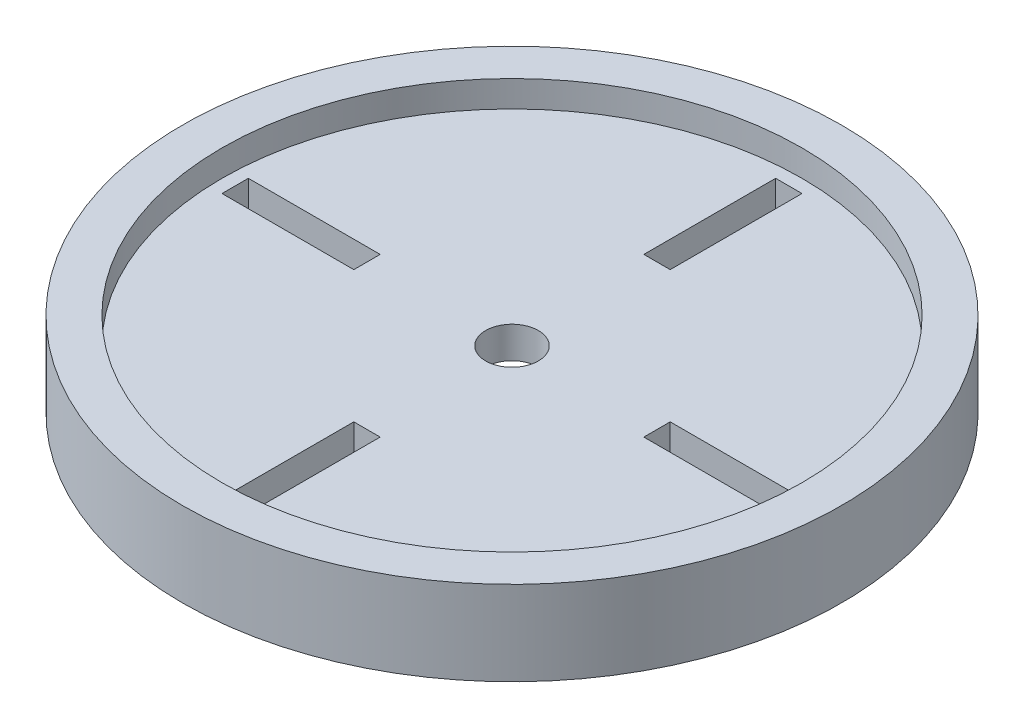
ISO-10303-21;
HEADER;
FILE_DESCRIPTION(('STEP AP214'),'2;1');
FILE_NAME('part.step','',(''),(''),'','','');
FILE_SCHEMA(('AUTOMOTIVE_DESIGN { 1 0 10303 214 1 1 1 1 }'));
ENDSEC;
DATA;
#1=APPLICATION_CONTEXT('core data for automotive mechanical design processes');
#2=APPLICATION_PROTOCOL_DEFINITION('international standard','automotive_design',2000,#1);
#3=PRODUCT_CONTEXT('',#1,'mechanical');
#4=PRODUCT('Part','Part','',(#3));
#5=PRODUCT_RELATED_PRODUCT_CATEGORY('part','',(#4));
#6=PRODUCT_DEFINITION_FORMATION('','',#4);
#7=PRODUCT_DEFINITION_CONTEXT('part definition',#1,'design');
#8=PRODUCT_DEFINITION('design','',#6,#7);
#9=PRODUCT_DEFINITION_SHAPE('','',#8);
#10=(LENGTH_UNIT() NAMED_UNIT(*) SI_UNIT(.MILLI.,.METRE.));
#11=(NAMED_UNIT(*) PLANE_ANGLE_UNIT() SI_UNIT($,.RADIAN.));
#12=(NAMED_UNIT(*) SI_UNIT($,.STERADIAN.) SOLID_ANGLE_UNIT());
#13=UNCERTAINTY_MEASURE_WITH_UNIT(LENGTH_MEASURE(1.E-05),#10,'distance_accuracy_value','');
#14=(GEOMETRIC_REPRESENTATION_CONTEXT(3) GLOBAL_UNCERTAINTY_ASSIGNED_CONTEXT((#13)) GLOBAL_UNIT_ASSIGNED_CONTEXT((#10,
#11,#12)) REPRESENTATION_CONTEXT('',''));
#15=CARTESIAN_POINT('',(0.,0.,0.));
#16=DIRECTION('',(0.,0.,1.));
#17=DIRECTION('',(1.,0.,0.));
#18=AXIS2_PLACEMENT_3D('',#15,#16,#17);
#19=CARTESIAN_POINT('',(0.,-8.,0.));
#20=DIRECTION('',(0.,1.,0.));
#21=DIRECTION('',(0.,0.,1.));
#22=AXIS2_PLACEMENT_3D('',#19,#20,#21);
#23=CYLINDRICAL_SURFACE('',#22,62.5);
#24=CARTESIAN_POINT('',(0.,-8.,0.));
#25=DIRECTION('',(0.,1.,0.));
#26=DIRECTION('',(0.,0.,1.));
#27=AXIS2_PLACEMENT_3D('',#24,#25,#26);
#28=CIRCLE('',#27,62.5);
#29=CARTESIAN_POINT('',(0.,-8.,62.5));
#30=VERTEX_POINT('',#29);
#31=EDGE_CURVE('E11',#30,#30,#28,.T.);
#32=ORIENTED_EDGE('',*,*,#31,.T.);
#33=EDGE_LOOP('',(#32));
#34=FACE_BOUND('',#33,.T.);
#35=CARTESIAN_POINT('',(0.,8.,0.));
#36=DIRECTION('',(0.,1.,0.));
#37=DIRECTION('',(0.,0.,1.));
#38=AXIS2_PLACEMENT_3D('',#35,#36,#37);
#39=CIRCLE('',#38,62.5);
#40=CARTESIAN_POINT('',(0.,8.,62.5));
#41=VERTEX_POINT('',#40);
#42=EDGE_CURVE('E44',#41,#41,#39,.T.);
#43=ORIENTED_EDGE('',*,*,#42,.F.);
#44=EDGE_LOOP('',(#43));
#45=FACE_BOUND('',#44,.T.);
#46=ADVANCED_FACE('F37',(#34,#45),#23,.T.);
#47=CARTESIAN_POINT('',(0.,-8.,0.));
#48=DIRECTION('',(0.,1.,0.));
#49=DIRECTION('',(0.,0.,1.));
#50=AXIS2_PLACEMENT_3D('',#47,#48,#49);
#51=PLANE('',#50);
#52=CARTESIAN_POINT('',(0.,-8.,0.));
#53=DIRECTION('',(0.,-1.,0.));
#54=DIRECTION('',(0.,0.,-1.));
#55=AXIS2_PLACEMENT_3D('',#52,#53,#54);
#56=CIRCLE('',#55,55.);
#57=CARTESIAN_POINT('',(0.,-8.,-55.));
#58=VERTEX_POINT('',#57);
#59=EDGE_CURVE('E277',#58,#58,#56,.T.);
#60=ORIENTED_EDGE('',*,*,#59,.F.);
#61=EDGE_LOOP('',(#60));
#62=FACE_BOUND('',#61,.T.);
#63=ORIENTED_EDGE('',*,*,#31,.F.);
#64=EDGE_LOOP('',(#63));
#65=FACE_BOUND('',#64,.T.);
#66=ADVANCED_FACE('F294',(#62,#65),#51,.F.);
#67=CARTESIAN_POINT('',(0.,8.,0.));
#68=DIRECTION('',(0.,1.,0.));
#69=DIRECTION('',(0.,0.,1.));
#70=AXIS2_PLACEMENT_3D('',#67,#68,#69);
#71=PLANE('',#70);
#72=CARTESIAN_POINT('',(0.,8.,0.));
#73=DIRECTION('',(0.,1.,0.));
#74=DIRECTION('',(0.,0.,1.));
#75=AXIS2_PLACEMENT_3D('',#72,#73,#74);
#76=CIRCLE('',#75,55.);
#77=CARTESIAN_POINT('',(0.,8.,55.));
#78=VERTEX_POINT('',#77);
#79=EDGE_CURVE('E281',#78,#78,#76,.T.);
#80=ORIENTED_EDGE('',*,*,#79,.F.);
#81=EDGE_LOOP('',(#80));
#82=FACE_BOUND('',#81,.T.);
#83=ORIENTED_EDGE('',*,*,#42,.T.);
#84=EDGE_LOOP('',(#83));
#85=FACE_BOUND('',#84,.T.);
#86=ADVANCED_FACE('F291',(#82,#85),#71,.T.);
#87=CARTESIAN_POINT('',(0.,3.,0.));
#88=DIRECTION('',(0.,1.,0.));
#89=DIRECTION('',(0.,0.,1.));
#90=AXIS2_PLACEMENT_3D('',#87,#88,#89);
#91=CYLINDRICAL_SURFACE('',#90,55.);
#92=CARTESIAN_POINT('',(0.,3.,0.));
#93=DIRECTION('',(0.,1.,0.));
#94=DIRECTION('',(0.,0.,1.));
#95=AXIS2_PLACEMENT_3D('',#92,#93,#94);
#96=CIRCLE('',#95,55.);
#97=CARTESIAN_POINT('',(0.,3.,55.));
#98=VERTEX_POINT('',#97);
#99=EDGE_CURVE('E284',#98,#98,#96,.T.);
#100=ORIENTED_EDGE('',*,*,#99,.F.);
#101=EDGE_LOOP('',(#100));
#102=FACE_BOUND('',#101,.T.);
#103=ORIENTED_EDGE('',*,*,#79,.T.);
#104=EDGE_LOOP('',(#103));
#105=FACE_BOUND('',#104,.T.);
#106=ADVANCED_FACE('F305',(#102,#105),#91,.F.);
#107=CARTESIAN_POINT('',(0.,3.,0.));
#108=DIRECTION('',(0.,1.,0.));
#109=DIRECTION('',(0.,0.,1.));
#110=AXIS2_PLACEMENT_3D('',#107,#108,#109);
#111=PLANE('',#110);
#112=DIRECTION('',(-1.,0.,0.));
#113=VECTOR('',#112,1.);
#114=CARTESIAN_POINT('',(0.,3.,-2.5));
#115=LINE('',#114,#113);
#116=CARTESIAN_POINT('',(-27.5,3.,-2.5000000000001));
#117=VERTEX_POINT('',#116);
#118=CARTESIAN_POINT('',(-52.5,3.,-2.50000000000018));
#119=VERTEX_POINT('',#118);
#120=EDGE_CURVE('E240',#117,#119,#115,.T.);
#121=ORIENTED_EDGE('',*,*,#120,.F.);
#122=DIRECTION('',(0.,0.,-1.));
#123=VECTOR('',#122,1.);
#124=CARTESIAN_POINT('',(-27.5,3.,0.));
#125=LINE('',#124,#123);
#126=CARTESIAN_POINT('',(-27.5,3.,2.4999999999999));
#127=VERTEX_POINT('',#126);
#128=EDGE_CURVE('E235',#127,#117,#125,.T.);
#129=ORIENTED_EDGE('',*,*,#128,.F.);
#130=DIRECTION('',(1.,0.,0.));
#131=VECTOR('',#130,1.);
#132=CARTESIAN_POINT('',(0.,3.,2.5));
#133=LINE('',#132,#131);
#134=CARTESIAN_POINT('',(-52.5,3.,2.49999999999982));
#135=VERTEX_POINT('',#134);
#136=EDGE_CURVE('E154',#135,#127,#133,.T.);
#137=ORIENTED_EDGE('',*,*,#136,.F.);
#138=DIRECTION('',(0.,0.,1.));
#139=VECTOR('',#138,1.);
#140=CARTESIAN_POINT('',(-52.5,3.,-1.83302770289265E-13));
#141=LINE('',#140,#139);
#142=EDGE_CURVE('E238',#119,#135,#141,.T.);
#143=ORIENTED_EDGE('',*,*,#142,.F.);
#144=EDGE_LOOP('',(#121,#129,#137,#143));
#145=FACE_BOUND('',#144,.T.);
#146=DIRECTION('',(0.,0.,-1.));
#147=VECTOR('',#146,1.);
#148=CARTESIAN_POINT('',(2.5,3.,0.));
#149=LINE('',#148,#147);
#150=CARTESIAN_POINT('',(2.5,3.,-27.5));
#151=VERTEX_POINT('',#150);
#152=CARTESIAN_POINT('',(2.5,3.,-52.5));
#153=VERTEX_POINT('',#152);
#154=EDGE_CURVE('E233',#151,#153,#149,.T.);
#155=ORIENTED_EDGE('',*,*,#154,.F.);
#156=DIRECTION('',(1.,0.,0.));
#157=VECTOR('',#156,1.);
#158=CARTESIAN_POINT('',(0.,3.,-27.5));
#159=LINE('',#158,#157);
#160=CARTESIAN_POINT('',(-2.5,3.,-27.5));
#161=VERTEX_POINT('',#160);
#162=EDGE_CURVE('E227',#161,#151,#159,.T.);
#163=ORIENTED_EDGE('',*,*,#162,.F.);
#164=DIRECTION('',(0.,0.,1.));
#165=VECTOR('',#164,1.);
#166=CARTESIAN_POINT('',(-2.5,3.,0.));
#167=LINE('',#166,#165);
#168=CARTESIAN_POINT('',(-2.5,3.,-52.5));
#169=VERTEX_POINT('',#168);
#170=EDGE_CURVE('E229',#169,#161,#167,.T.);
#171=ORIENTED_EDGE('',*,*,#170,.F.);
#172=DIRECTION('',(-1.,0.,0.));
#173=VECTOR('',#172,1.);
#174=CARTESIAN_POINT('',(0.,3.,-52.5));
#175=LINE('',#174,#173);
#176=EDGE_CURVE('E231',#153,#169,#175,.T.);
#177=ORIENTED_EDGE('',*,*,#176,.F.);
#178=EDGE_LOOP('',(#155,#163,#171,#177));
#179=FACE_BOUND('',#178,.T.);
#180=DIRECTION('',(1.,0.,0.));
#181=VECTOR('',#180,1.);
#182=CARTESIAN_POINT('',(0.,3.,2.5));
#183=LINE('',#182,#181);
#184=CARTESIAN_POINT('',(27.5,3.,2.50000000000029));
#185=VERTEX_POINT('',#184);
#186=CARTESIAN_POINT('',(52.5,3.,2.50000000000055));
#187=VERTEX_POINT('',#186);
#188=EDGE_CURVE('E225',#185,#187,#183,.T.);
#189=ORIENTED_EDGE('',*,*,#188,.F.);
#190=DIRECTION('',(0.,0.,1.));
#191=VECTOR('',#190,1.);
#192=CARTESIAN_POINT('',(27.5,3.,2.88047210454559E-13));
#193=LINE('',#192,#191);
#194=CARTESIAN_POINT('',(27.5,3.,-2.49999999999971));
#195=VERTEX_POINT('',#194);
#196=EDGE_CURVE('E178',#195,#185,#193,.T.);
#197=ORIENTED_EDGE('',*,*,#196,.F.);
#198=DIRECTION('',(-1.,0.,0.));
#199=VECTOR('',#198,1.);
#200=CARTESIAN_POINT('',(0.,3.,-2.5));
#201=LINE('',#200,#199);
#202=CARTESIAN_POINT('',(52.5,3.,-2.49999999999945));
#203=VERTEX_POINT('',#202);
#204=EDGE_CURVE('E220',#203,#195,#201,.T.);
#205=ORIENTED_EDGE('',*,*,#204,.F.);
#206=DIRECTION('',(0.,0.,-1.));
#207=VECTOR('',#206,1.);
#208=CARTESIAN_POINT('',(52.5,3.,5.49908310867794E-13));
#209=LINE('',#208,#207);
#210=EDGE_CURVE('E223',#187,#203,#209,.T.);
#211=ORIENTED_EDGE('',*,*,#210,.F.);
#212=EDGE_LOOP('',(#189,#197,#205,#211));
#213=FACE_BOUND('',#212,.T.);
#214=DIRECTION('',(0.,0.,1.));
#215=VECTOR('',#214,1.);
#216=CARTESIAN_POINT('',(-2.5,3.,0.));
#217=LINE('',#216,#215);
#218=CARTESIAN_POINT('',(-2.5,3.,27.5));
#219=VERTEX_POINT('',#218);
#220=CARTESIAN_POINT('',(-2.5,3.,52.5));
#221=VERTEX_POINT('',#220);
#222=EDGE_CURVE('E269',#219,#221,#217,.T.);
#223=ORIENTED_EDGE('',*,*,#222,.F.);
#224=DIRECTION('',(-1.,0.,0.));
#225=VECTOR('',#224,1.);
#226=CARTESIAN_POINT('',(0.,3.,27.5));
#227=LINE('',#226,#225);
#228=CARTESIAN_POINT('',(2.5,3.,27.5));
#229=VERTEX_POINT('',#228);
#230=EDGE_CURVE('E256',#229,#219,#227,.T.);
#231=ORIENTED_EDGE('',*,*,#230,.F.);
#232=DIRECTION('',(0.,0.,-1.));
#233=VECTOR('',#232,1.);
#234=CARTESIAN_POINT('',(2.5,3.,0.));
#235=LINE('',#234,#233);
#236=CARTESIAN_POINT('',(2.5,3.,52.5));
#237=VERTEX_POINT('',#236);
#238=EDGE_CURVE('E264',#237,#229,#235,.T.);
#239=ORIENTED_EDGE('',*,*,#238,.F.);
#240=DIRECTION('',(1.,0.,0.));
#241=VECTOR('',#240,1.);
#242=CARTESIAN_POINT('',(0.,3.,52.5));
#243=LINE('',#242,#241);
#244=EDGE_CURVE('E267',#221,#237,#243,.T.);
#245=ORIENTED_EDGE('',*,*,#244,.F.);
#246=EDGE_LOOP('',(#223,#231,#239,#245));
#247=FACE_BOUND('',#246,.T.);
#248=CARTESIAN_POINT('',(0.,3.,0.));
#249=DIRECTION('',(0.,1.,0.));
#250=DIRECTION('',(0.,0.,1.));
#251=AXIS2_PLACEMENT_3D('',#248,#249,#250);
#252=CIRCLE('',#251,5.);
#253=CARTESIAN_POINT('',(0.,3.,5.));
#254=VERTEX_POINT('',#253);
#255=EDGE_CURVE('E274',#254,#254,#252,.T.);
#256=ORIENTED_EDGE('',*,*,#255,.F.);
#257=EDGE_LOOP('',(#256));
#258=FACE_BOUND('',#257,.T.);
#259=ORIENTED_EDGE('',*,*,#99,.T.);
#260=EDGE_LOOP('',(#259));
#261=FACE_BOUND('',#260,.T.);
#262=ADVANCED_FACE('F312',(#145,#179,#213,#247,#258,#261),#111,.T.);
#263=CARTESIAN_POINT('',(0.,-3.,0.));
#264=DIRECTION('',(0.,-1.,0.));
#265=DIRECTION('',(0.,0.,-1.));
#266=AXIS2_PLACEMENT_3D('',#263,#264,#265);
#267=CYLINDRICAL_SURFACE('',#266,55.);
#268=CARTESIAN_POINT('',(0.,-3.,0.));
#269=DIRECTION('',(0.,-1.,0.));
#270=DIRECTION('',(0.,0.,-1.));
#271=AXIS2_PLACEMENT_3D('',#268,#269,#270);
#272=CIRCLE('',#271,55.);
#273=CARTESIAN_POINT('',(0.,-3.,-55.));
#274=VERTEX_POINT('',#273);
#275=EDGE_CURVE('E278',#274,#274,#272,.T.);
#276=ORIENTED_EDGE('',*,*,#275,.F.);
#277=EDGE_LOOP('',(#276));
#278=FACE_BOUND('',#277,.T.);
#279=ORIENTED_EDGE('',*,*,#59,.T.);
#280=EDGE_LOOP('',(#279));
#281=FACE_BOUND('',#280,.T.);
#282=ADVANCED_FACE('F316',(#278,#281),#267,.F.);
#283=CARTESIAN_POINT('',(0.,-3.,0.));
#284=DIRECTION('',(0.,-1.,0.));
#285=DIRECTION('',(0.,0.,-1.));
#286=AXIS2_PLACEMENT_3D('',#283,#284,#285);
#287=PLANE('',#286);
#288=DIRECTION('',(1.,0.,0.));
#289=VECTOR('',#288,1.);
#290=CARTESIAN_POINT('',(-27.5,-3.,-2.5000000000001));
#291=LINE('',#290,#289);
#292=CARTESIAN_POINT('',(-52.5,-3.,-2.50000000000018));
#293=VERTEX_POINT('',#292);
#294=CARTESIAN_POINT('',(-27.5,-3.,-2.5000000000001));
#295=VERTEX_POINT('',#294);
#296=EDGE_CURVE('E166',#293,#295,#291,.T.);
#297=ORIENTED_EDGE('',*,*,#296,.F.);
#298=DIRECTION('',(0.,0.,-1.));
#299=VECTOR('',#298,1.);
#300=CARTESIAN_POINT('',(-52.5,-3.,2.49999999999982));
#301=LINE('',#300,#299);
#302=CARTESIAN_POINT('',(-52.5,-3.,2.49999999999982));
#303=VERTEX_POINT('',#302);
#304=EDGE_CURVE('E171',#303,#293,#301,.T.);
#305=ORIENTED_EDGE('',*,*,#304,.F.);
#306=DIRECTION('',(-1.,0.,0.));
#307=VECTOR('',#306,1.);
#308=CARTESIAN_POINT('',(-27.5,-3.,2.4999999999999));
#309=LINE('',#308,#307);
#310=CARTESIAN_POINT('',(-27.5,-3.,2.4999999999999));
#311=VERTEX_POINT('',#310);
#312=EDGE_CURVE('E151',#311,#303,#309,.T.);
#313=ORIENTED_EDGE('',*,*,#312,.F.);
#314=DIRECTION('',(0.,0.,1.));
#315=VECTOR('',#314,1.);
#316=CARTESIAN_POINT('',(-27.5,-3.,2.4999999999999));
#317=LINE('',#316,#315);
#318=EDGE_CURVE('E161',#295,#311,#317,.T.);
#319=ORIENTED_EDGE('',*,*,#318,.F.);
#320=EDGE_LOOP('',(#297,#305,#313,#319));
#321=FACE_BOUND('',#320,.T.);
#322=DIRECTION('',(0.,0.,1.));
#323=VECTOR('',#322,1.);
#324=CARTESIAN_POINT('',(2.5,-3.,-27.5));
#325=LINE('',#324,#323);
#326=CARTESIAN_POINT('',(2.5,-3.,-52.5));
#327=VERTEX_POINT('',#326);
#328=CARTESIAN_POINT('',(2.5,-3.,-27.5));
#329=VERTEX_POINT('',#328);
#330=EDGE_CURVE('E181',#327,#329,#325,.T.);
#331=ORIENTED_EDGE('',*,*,#330,.F.);
#332=DIRECTION('',(1.,0.,0.));
#333=VECTOR('',#332,1.);
#334=CARTESIAN_POINT('',(-2.5,-3.,-52.5));
#335=LINE('',#334,#333);
#336=CARTESIAN_POINT('',(-2.5,-3.,-52.5));
#337=VERTEX_POINT('',#336);
#338=EDGE_CURVE('E189',#337,#327,#335,.T.);
#339=ORIENTED_EDGE('',*,*,#338,.F.);
#340=DIRECTION('',(0.,0.,-1.));
#341=VECTOR('',#340,1.);
#342=CARTESIAN_POINT('',(-2.5,-3.,-27.5));
#343=LINE('',#342,#341);
#344=CARTESIAN_POINT('',(-2.5,-3.,-27.5));
#345=VERTEX_POINT('',#344);
#346=EDGE_CURVE('E186',#345,#337,#343,.T.);
#347=ORIENTED_EDGE('',*,*,#346,.F.);
#348=DIRECTION('',(-1.,0.,0.));
#349=VECTOR('',#348,1.);
#350=CARTESIAN_POINT('',(-2.5,-3.,-27.5));
#351=LINE('',#350,#349);
#352=EDGE_CURVE('E183',#329,#345,#351,.T.);
#353=ORIENTED_EDGE('',*,*,#352,.F.);
#354=EDGE_LOOP('',(#331,#339,#347,#353));
#355=FACE_BOUND('',#354,.T.);
#356=DIRECTION('',(-1.,0.,0.));
#357=VECTOR('',#356,1.);
#358=CARTESIAN_POINT('',(27.5,-3.,2.50000000000029));
#359=LINE('',#358,#357);
#360=CARTESIAN_POINT('',(52.5,-3.,2.50000000000055));
#361=VERTEX_POINT('',#360);
#362=CARTESIAN_POINT('',(27.5,-3.,2.50000000000029));
#363=VERTEX_POINT('',#362);
#364=EDGE_CURVE('E200',#361,#363,#359,.T.);
#365=ORIENTED_EDGE('',*,*,#364,.F.);
#366=DIRECTION('',(0.,0.,1.));
#367=VECTOR('',#366,1.);
#368=CARTESIAN_POINT('',(52.5,-3.,-2.49999999999945));
#369=LINE('',#368,#367);
#370=CARTESIAN_POINT('',(52.5,-3.,-2.49999999999945));
#371=VERTEX_POINT('',#370);
#372=EDGE_CURVE('E208',#371,#361,#369,.T.);
#373=ORIENTED_EDGE('',*,*,#372,.F.);
#374=DIRECTION('',(1.,0.,0.));
#375=VECTOR('',#374,1.);
#376=CARTESIAN_POINT('',(27.5,-3.,-2.49999999999971));
#377=LINE('',#376,#375);
#378=CARTESIAN_POINT('',(27.5,-3.,-2.49999999999971));
#379=VERTEX_POINT('',#378);
#380=EDGE_CURVE('E205',#379,#371,#377,.T.);
#381=ORIENTED_EDGE('',*,*,#380,.F.);
#382=DIRECTION('',(0.,0.,-1.));
#383=VECTOR('',#382,1.);
#384=CARTESIAN_POINT('',(27.5,-3.,-2.49999999999971));
#385=LINE('',#384,#383);
#386=EDGE_CURVE('E202',#363,#379,#385,.T.);
#387=ORIENTED_EDGE('',*,*,#386,.F.);
#388=EDGE_LOOP('',(#365,#373,#381,#387));
#389=FACE_BOUND('',#388,.T.);
#390=DIRECTION('',(0.,0.,-1.));
#391=VECTOR('',#390,1.);
#392=CARTESIAN_POINT('',(-2.5,-3.,27.5));
#393=LINE('',#392,#391);
#394=CARTESIAN_POINT('',(-2.5,-3.,52.5));
#395=VERTEX_POINT('',#394);
#396=CARTESIAN_POINT('',(-2.5,-3.,27.5));
#397=VERTEX_POINT('',#396);
#398=EDGE_CURVE('E242',#395,#397,#393,.T.);
#399=ORIENTED_EDGE('',*,*,#398,.F.);
#400=DIRECTION('',(-1.,0.,0.));
#401=VECTOR('',#400,1.);
#402=CARTESIAN_POINT('',(2.5,-3.,52.5));
#403=LINE('',#402,#401);
#404=CARTESIAN_POINT('',(2.5,-3.,52.5));
#405=VERTEX_POINT('',#404);
#406=EDGE_CURVE('E250',#405,#395,#403,.T.);
#407=ORIENTED_EDGE('',*,*,#406,.F.);
#408=DIRECTION('',(0.,0.,1.));
#409=VECTOR('',#408,1.);
#410=CARTESIAN_POINT('',(2.5,-3.,27.5));
#411=LINE('',#410,#409);
#412=CARTESIAN_POINT('',(2.5,-3.,27.5));
#413=VERTEX_POINT('',#412);
#414=EDGE_CURVE('E247',#413,#405,#411,.T.);
#415=ORIENTED_EDGE('',*,*,#414,.F.);
#416=DIRECTION('',(1.,0.,0.));
#417=VECTOR('',#416,1.);
#418=CARTESIAN_POINT('',(2.5,-3.,27.5));
#419=LINE('',#418,#417);
#420=EDGE_CURVE('E244',#397,#413,#419,.T.);
#421=ORIENTED_EDGE('',*,*,#420,.F.);
#422=EDGE_LOOP('',(#399,#407,#415,#421));
#423=FACE_BOUND('',#422,.T.);
#424=CARTESIAN_POINT('',(0.,-3.,0.));
#425=DIRECTION('',(0.,-1.,0.));
#426=DIRECTION('',(0.,0.,-1.));
#427=AXIS2_PLACEMENT_3D('',#424,#425,#426);
#428=CIRCLE('',#427,5.);
#429=CARTESIAN_POINT('',(0.,-3.,-5.));
#430=VERTEX_POINT('',#429);
#431=EDGE_CURVE('E271',#430,#430,#428,.T.);
#432=ORIENTED_EDGE('',*,*,#431,.F.);
#433=EDGE_LOOP('',(#432));
#434=FACE_BOUND('',#433,.T.);
#435=ORIENTED_EDGE('',*,*,#275,.T.);
#436=EDGE_LOOP('',(#435));
#437=FACE_BOUND('',#436,.T.);
#438=ADVANCED_FACE('F168',(#321,#355,#389,#423,#434,#437),#287,.T.);
#439=CARTESIAN_POINT('',(0.,8.,0.));
#440=DIRECTION('',(0.,-1.,0.));
#441=DIRECTION('',(0.,0.,-1.));
#442=AXIS2_PLACEMENT_3D('',#439,#440,#441);
#443=CYLINDRICAL_SURFACE('',#442,5.);
#444=ORIENTED_EDGE('',*,*,#255,.T.);
#445=EDGE_LOOP('',(#444));
#446=FACE_BOUND('',#445,.T.);
#447=ORIENTED_EDGE('',*,*,#431,.T.);
#448=EDGE_LOOP('',(#447));
#449=FACE_BOUND('',#448,.T.);
#450=ADVANCED_FACE('F323',(#446,#449),#443,.F.);
#451=CARTESIAN_POINT('',(-2.5,8.,27.5));
#452=DIRECTION('',(-1.,0.,0.));
#453=DIRECTION('',(0.,0.,1.));
#454=AXIS2_PLACEMENT_3D('',#451,#452,#453);
#455=PLANE('',#454);
#456=ORIENTED_EDGE('',*,*,#222,.T.);
#457=DIRECTION('',(0.,-1.,0.));
#458=VECTOR('',#457,1.);
#459=CARTESIAN_POINT('',(-2.5,8.,52.5));
#460=LINE('',#459,#458);
#461=EDGE_CURVE('E254',#221,#395,#460,.T.);
#462=ORIENTED_EDGE('',*,*,#461,.T.);
#463=ORIENTED_EDGE('',*,*,#398,.T.);
#464=DIRECTION('',(0.,-1.,0.));
#465=VECTOR('',#464,1.);
#466=CARTESIAN_POINT('',(-2.5,8.,27.5));
#467=LINE('',#466,#465);
#468=EDGE_CURVE('E253',#219,#397,#467,.T.);
#469=ORIENTED_EDGE('',*,*,#468,.F.);
#470=EDGE_LOOP('',(#456,#462,#463,#469));
#471=FACE_BOUND('',#470,.T.);
#472=ADVANCED_FACE('F326',(#471),#455,.F.);
#473=CARTESIAN_POINT('',(2.5,8.,52.5));
#474=DIRECTION('',(0.,0.,1.));
#475=DIRECTION('',(1.,0.,0.));
#476=AXIS2_PLACEMENT_3D('',#473,#474,#475);
#477=PLANE('',#476);
#478=ORIENTED_EDGE('',*,*,#244,.T.);
#479=DIRECTION('',(0.,-1.,0.));
#480=VECTOR('',#479,1.);
#481=CARTESIAN_POINT('',(2.5,8.,52.5));
#482=LINE('',#481,#480);
#483=EDGE_CURVE('E257',#237,#405,#482,.T.);
#484=ORIENTED_EDGE('',*,*,#483,.T.);
#485=ORIENTED_EDGE('',*,*,#406,.T.);
#486=ORIENTED_EDGE('',*,*,#461,.F.);
#487=EDGE_LOOP('',(#478,#484,#485,#486));
#488=FACE_BOUND('',#487,.T.);
#489=ADVANCED_FACE('F330',(#488),#477,.F.);
#490=CARTESIAN_POINT('',(2.5,8.,27.5));
#491=DIRECTION('',(1.,0.,0.));
#492=DIRECTION('',(0.,0.,-1.));
#493=AXIS2_PLACEMENT_3D('',#490,#491,#492);
#494=PLANE('',#493);
#495=ORIENTED_EDGE('',*,*,#238,.T.);
#496=DIRECTION('',(0.,-1.,0.));
#497=VECTOR('',#496,1.);
#498=CARTESIAN_POINT('',(2.5,8.,27.5));
#499=LINE('',#498,#497);
#500=EDGE_CURVE('E259',#229,#413,#499,.T.);
#501=ORIENTED_EDGE('',*,*,#500,.T.);
#502=ORIENTED_EDGE('',*,*,#414,.T.);
#503=ORIENTED_EDGE('',*,*,#483,.F.);
#504=EDGE_LOOP('',(#495,#501,#502,#503));
#505=FACE_BOUND('',#504,.T.);
#506=ADVANCED_FACE('F336',(#505),#494,.F.);
#507=CARTESIAN_POINT('',(2.5,8.,27.5));
#508=DIRECTION('',(0.,0.,-1.));
#509=DIRECTION('',(-1.,0.,0.));
#510=AXIS2_PLACEMENT_3D('',#507,#508,#509);
#511=PLANE('',#510);
#512=ORIENTED_EDGE('',*,*,#230,.T.);
#513=ORIENTED_EDGE('',*,*,#468,.T.);
#514=ORIENTED_EDGE('',*,*,#420,.T.);
#515=ORIENTED_EDGE('',*,*,#500,.F.);
#516=EDGE_LOOP('',(#512,#513,#514,#515));
#517=FACE_BOUND('',#516,.T.);
#518=ADVANCED_FACE('F332',(#517),#511,.F.);
#519=CARTESIAN_POINT('',(27.5,8.,2.50000000000029));
#520=DIRECTION('',(0.,0.,1.));
#521=DIRECTION('',(1.,0.,0.));
#522=AXIS2_PLACEMENT_3D('',#519,#520,#521);
#523=PLANE('',#522);
#524=ORIENTED_EDGE('',*,*,#188,.T.);
#525=DIRECTION('',(0.,-1.,0.));
#526=VECTOR('',#525,1.);
#527=CARTESIAN_POINT('',(52.5,8.,2.50000000000055));
#528=LINE('',#527,#526);
#529=EDGE_CURVE('E184',#187,#361,#528,.T.);
#530=ORIENTED_EDGE('',*,*,#529,.T.);
#531=ORIENTED_EDGE('',*,*,#364,.T.);
#532=DIRECTION('',(0.,-1.,0.));
#533=VECTOR('',#532,1.);
#534=CARTESIAN_POINT('',(27.5,8.,2.50000000000029));
#535=LINE('',#534,#533);
#536=EDGE_CURVE('E211',#185,#363,#535,.T.);
#537=ORIENTED_EDGE('',*,*,#536,.F.);
#538=EDGE_LOOP('',(#524,#530,#531,#537));
#539=FACE_BOUND('',#538,.T.);
#540=ADVANCED_FACE('F335',(#539),#523,.F.);
#541=CARTESIAN_POINT('',(52.5,8.,-2.49999999999945));
#542=DIRECTION('',(1.,0.,0.));
#543=DIRECTION('',(0.,0.,-1.));
#544=AXIS2_PLACEMENT_3D('',#541,#542,#543);
#545=PLANE('',#544);
#546=ORIENTED_EDGE('',*,*,#210,.T.);
#547=DIRECTION('',(0.,-1.,0.));
#548=VECTOR('',#547,1.);
#549=CARTESIAN_POINT('',(52.5,8.,-2.49999999999945));
#550=LINE('',#549,#548);
#551=EDGE_CURVE('E213',#203,#371,#550,.T.);
#552=ORIENTED_EDGE('',*,*,#551,.T.);
#553=ORIENTED_EDGE('',*,*,#372,.T.);
#554=ORIENTED_EDGE('',*,*,#529,.F.);
#555=EDGE_LOOP('',(#546,#552,#553,#554));
#556=FACE_BOUND('',#555,.T.);
#557=ADVANCED_FACE('F346',(#556),#545,.F.);
#558=CARTESIAN_POINT('',(27.5,8.,-2.49999999999971));
#559=DIRECTION('',(0.,0.,-1.));
#560=DIRECTION('',(-1.,0.,0.));
#561=AXIS2_PLACEMENT_3D('',#558,#559,#560);
#562=PLANE('',#561);
#563=ORIENTED_EDGE('',*,*,#204,.T.);
#564=DIRECTION('',(0.,-1.,0.));
#565=VECTOR('',#564,1.);
#566=CARTESIAN_POINT('',(27.5,8.,-2.49999999999971));
#567=LINE('',#566,#565);
#568=EDGE_CURVE('E215',#195,#379,#567,.T.);
#569=ORIENTED_EDGE('',*,*,#568,.T.);
#570=ORIENTED_EDGE('',*,*,#380,.T.);
#571=ORIENTED_EDGE('',*,*,#551,.F.);
#572=EDGE_LOOP('',(#563,#569,#570,#571));
#573=FACE_BOUND('',#572,.T.);
#574=ADVANCED_FACE('F352',(#573),#562,.F.);
#575=CARTESIAN_POINT('',(27.5,8.,-2.49999999999971));
#576=DIRECTION('',(-1.,0.,0.));
#577=DIRECTION('',(0.,0.,1.));
#578=AXIS2_PLACEMENT_3D('',#575,#576,#577);
#579=PLANE('',#578);
#580=ORIENTED_EDGE('',*,*,#196,.T.);
#581=ORIENTED_EDGE('',*,*,#536,.T.);
#582=ORIENTED_EDGE('',*,*,#386,.T.);
#583=ORIENTED_EDGE('',*,*,#568,.F.);
#584=EDGE_LOOP('',(#580,#581,#582,#583));
#585=FACE_BOUND('',#584,.T.);
#586=ADVANCED_FACE('F348',(#585),#579,.F.);
#587=CARTESIAN_POINT('',(2.5,8.,-27.5));
#588=DIRECTION('',(1.,0.,0.));
#589=DIRECTION('',(0.,0.,-1.));
#590=AXIS2_PLACEMENT_3D('',#587,#588,#589);
#591=PLANE('',#590);
#592=ORIENTED_EDGE('',*,*,#154,.T.);
#593=DIRECTION('',(0.,-1.,0.));
#594=VECTOR('',#593,1.);
#595=CARTESIAN_POINT('',(2.5,8.,-52.5));
#596=LINE('',#595,#594);
#597=EDGE_CURVE('E193',#153,#327,#596,.T.);
#598=ORIENTED_EDGE('',*,*,#597,.T.);
#599=ORIENTED_EDGE('',*,*,#330,.T.);
#600=DIRECTION('',(0.,-1.,0.));
#601=VECTOR('',#600,1.);
#602=CARTESIAN_POINT('',(2.5,8.,-27.5));
#603=LINE('',#602,#601);
#604=EDGE_CURVE('E192',#151,#329,#603,.T.);
#605=ORIENTED_EDGE('',*,*,#604,.F.);
#606=EDGE_LOOP('',(#592,#598,#599,#605));
#607=FACE_BOUND('',#606,.T.);
#608=ADVANCED_FACE('F351',(#607),#591,.F.);
#609=CARTESIAN_POINT('',(-2.5,8.,-52.5));
#610=DIRECTION('',(0.,0.,-1.));
#611=DIRECTION('',(-1.,0.,0.));
#612=AXIS2_PLACEMENT_3D('',#609,#610,#611);
#613=PLANE('',#612);
#614=ORIENTED_EDGE('',*,*,#176,.T.);
#615=DIRECTION('',(0.,-1.,0.));
#616=VECTOR('',#615,1.);
#617=CARTESIAN_POINT('',(-2.5,8.,-52.5));
#618=LINE('',#617,#616);
#619=EDGE_CURVE('E195',#169,#337,#618,.T.);
#620=ORIENTED_EDGE('',*,*,#619,.T.);
#621=ORIENTED_EDGE('',*,*,#338,.T.);
#622=ORIENTED_EDGE('',*,*,#597,.F.);
#623=EDGE_LOOP('',(#614,#620,#621,#622));
#624=FACE_BOUND('',#623,.T.);
#625=ADVANCED_FACE('F362',(#624),#613,.F.);
#626=CARTESIAN_POINT('',(-2.5,8.,-27.5));
#627=DIRECTION('',(-1.,0.,0.));
#628=DIRECTION('',(0.,0.,1.));
#629=AXIS2_PLACEMENT_3D('',#626,#627,#628);
#630=PLANE('',#629);
#631=ORIENTED_EDGE('',*,*,#170,.T.);
#632=DIRECTION('',(0.,-1.,0.));
#633=VECTOR('',#632,1.);
#634=CARTESIAN_POINT('',(-2.5,8.,-27.5));
#635=LINE('',#634,#633);
#636=EDGE_CURVE('E59',#161,#345,#635,.T.);
#637=ORIENTED_EDGE('',*,*,#636,.T.);
#638=ORIENTED_EDGE('',*,*,#346,.T.);
#639=ORIENTED_EDGE('',*,*,#619,.F.);
#640=EDGE_LOOP('',(#631,#637,#638,#639));
#641=FACE_BOUND('',#640,.T.);
#642=ADVANCED_FACE('F368',(#641),#630,.F.);
#643=CARTESIAN_POINT('',(-2.5,8.,-27.5));
#644=DIRECTION('',(0.,0.,1.));
#645=DIRECTION('',(1.,0.,0.));
#646=AXIS2_PLACEMENT_3D('',#643,#644,#645);
#647=PLANE('',#646);
#648=ORIENTED_EDGE('',*,*,#162,.T.);
#649=ORIENTED_EDGE('',*,*,#604,.T.);
#650=ORIENTED_EDGE('',*,*,#352,.T.);
#651=ORIENTED_EDGE('',*,*,#636,.F.);
#652=EDGE_LOOP('',(#648,#649,#650,#651));
#653=FACE_BOUND('',#652,.T.);
#654=ADVANCED_FACE('F364',(#653),#647,.F.);
#655=CARTESIAN_POINT('',(-27.5,8.,-2.5000000000001));
#656=DIRECTION('',(0.,0.,-1.));
#657=DIRECTION('',(-1.,0.,0.));
#658=AXIS2_PLACEMENT_3D('',#655,#656,#657);
#659=PLANE('',#658);
#660=ORIENTED_EDGE('',*,*,#120,.T.);
#661=DIRECTION('',(0.,-1.,0.));
#662=VECTOR('',#661,1.);
#663=CARTESIAN_POINT('',(-52.5,8.,-2.50000000000018));
#664=LINE('',#663,#662);
#665=EDGE_CURVE('E176',#119,#293,#664,.T.);
#666=ORIENTED_EDGE('',*,*,#665,.T.);
#667=ORIENTED_EDGE('',*,*,#296,.T.);
#668=DIRECTION('',(0.,-1.,0.));
#669=VECTOR('',#668,1.);
#670=CARTESIAN_POINT('',(-27.5,8.,-2.5000000000001));
#671=LINE('',#670,#669);
#672=EDGE_CURVE('E157',#117,#295,#671,.T.);
#673=ORIENTED_EDGE('',*,*,#672,.F.);
#674=EDGE_LOOP('',(#660,#666,#667,#673));
#675=FACE_BOUND('',#674,.T.);
#676=ADVANCED_FACE('F367',(#675),#659,.F.);
#677=CARTESIAN_POINT('',(-52.5,8.,2.49999999999982));
#678=DIRECTION('',(-1.,0.,0.));
#679=DIRECTION('',(0.,0.,1.));
#680=AXIS2_PLACEMENT_3D('',#677,#678,#679);
#681=PLANE('',#680);
#682=ORIENTED_EDGE('',*,*,#142,.T.);
#683=DIRECTION('',(0.,-1.,0.));
#684=VECTOR('',#683,1.);
#685=CARTESIAN_POINT('',(-52.5,8.,2.49999999999982));
#686=LINE('',#685,#684);
#687=EDGE_CURVE('E156',#135,#303,#686,.T.);
#688=ORIENTED_EDGE('',*,*,#687,.T.);
#689=ORIENTED_EDGE('',*,*,#304,.T.);
#690=ORIENTED_EDGE('',*,*,#665,.F.);
#691=EDGE_LOOP('',(#682,#688,#689,#690));
#692=FACE_BOUND('',#691,.T.);
#693=ADVANCED_FACE('F377',(#692),#681,.F.);
#694=CARTESIAN_POINT('',(-27.5,8.,2.4999999999999));
#695=DIRECTION('',(0.,0.,1.));
#696=DIRECTION('',(1.,0.,0.));
#697=AXIS2_PLACEMENT_3D('',#694,#695,#696);
#698=PLANE('',#697);
#699=ORIENTED_EDGE('',*,*,#136,.T.);
#700=DIRECTION('',(0.,-1.,0.));
#701=VECTOR('',#700,1.);
#702=CARTESIAN_POINT('',(-27.5,8.,2.4999999999999));
#703=LINE('',#702,#701);
#704=EDGE_CURVE('E51',#127,#311,#703,.T.);
#705=ORIENTED_EDGE('',*,*,#704,.T.);
#706=ORIENTED_EDGE('',*,*,#312,.T.);
#707=ORIENTED_EDGE('',*,*,#687,.F.);
#708=EDGE_LOOP('',(#699,#705,#706,#707));
#709=FACE_BOUND('',#708,.T.);
#710=ADVANCED_FACE('F148',(#709),#698,.F.);
#711=CARTESIAN_POINT('',(-27.5,8.,2.4999999999999));
#712=DIRECTION('',(1.,0.,0.));
#713=DIRECTION('',(0.,0.,-1.));
#714=AXIS2_PLACEMENT_3D('',#711,#712,#713);
#715=PLANE('',#714);
#716=ORIENTED_EDGE('',*,*,#128,.T.);
#717=ORIENTED_EDGE('',*,*,#672,.T.);
#718=ORIENTED_EDGE('',*,*,#318,.T.);
#719=ORIENTED_EDGE('',*,*,#704,.F.);
#720=EDGE_LOOP('',(#716,#717,#718,#719));
#721=FACE_BOUND('',#720,.T.);
#722=ADVANCED_FACE('F162',(#721),#715,.F.);
#723=CLOSED_SHELL('',(#46,#66,#86,#106,#262,#282,#438,#450,#472,#489,#506,#518,#540,#557,#574,
#586,#608,#625,#642,#654,#676,#693,#710,#722));
#724=MANIFOLD_SOLID_BREP('B2',#723);
#725=ADVANCED_BREP_SHAPE_REPRESENTATION('',(#18,#724),#14);
#726=SHAPE_DEFINITION_REPRESENTATION(#9,#725);
ENDSEC;
END-ISO-10303-21;
